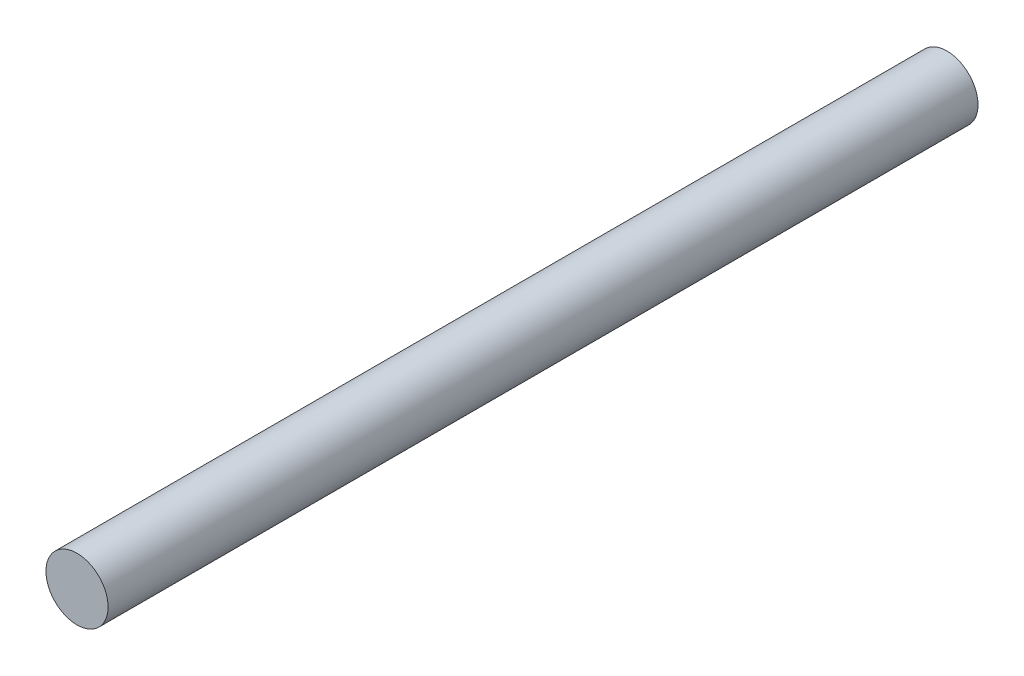
ISO-10303-21;
HEADER;
FILE_DESCRIPTION(('STEP AP214'),'2;1');
FILE_NAME('part.step','',(''),(''),'','','');
FILE_SCHEMA(('AUTOMOTIVE_DESIGN { 1 0 10303 214 1 1 1 1 }'));
ENDSEC;
DATA;
#1=APPLICATION_CONTEXT('core data for automotive mechanical design processes');
#2=APPLICATION_PROTOCOL_DEFINITION('international standard','automotive_design',2000,#1);
#3=PRODUCT_CONTEXT('',#1,'mechanical');
#4=PRODUCT('Part','Part','',(#3));
#5=PRODUCT_RELATED_PRODUCT_CATEGORY('part','',(#4));
#6=PRODUCT_DEFINITION_FORMATION('','',#4);
#7=PRODUCT_DEFINITION_CONTEXT('part definition',#1,'design');
#8=PRODUCT_DEFINITION('design','',#6,#7);
#9=PRODUCT_DEFINITION_SHAPE('','',#8);
#10=(LENGTH_UNIT() NAMED_UNIT(*) SI_UNIT(.MILLI.,.METRE.));
#11=(NAMED_UNIT(*) PLANE_ANGLE_UNIT() SI_UNIT($,.RADIAN.));
#12=(NAMED_UNIT(*) SI_UNIT($,.STERADIAN.) SOLID_ANGLE_UNIT());
#13=UNCERTAINTY_MEASURE_WITH_UNIT(LENGTH_MEASURE(1.E-05),#10,'distance_accuracy_value','');
#14=(GEOMETRIC_REPRESENTATION_CONTEXT(3) GLOBAL_UNCERTAINTY_ASSIGNED_CONTEXT((#13)) GLOBAL_UNIT_ASSIGNED_CONTEXT((#10,
#11,#12)) REPRESENTATION_CONTEXT('',''));
#15=CARTESIAN_POINT('',(0.,0.,0.));
#16=DIRECTION('',(0.,0.,1.));
#17=DIRECTION('',(1.,0.,0.));
#18=AXIS2_PLACEMENT_3D('',#15,#16,#17);
#19=CARTESIAN_POINT('',(0.,0.,140.));
#20=DIRECTION('',(0.,0.,-1.));
#21=DIRECTION('',(-1.,0.,0.));
#22=AXIS2_PLACEMENT_3D('',#19,#20,#21);
#23=CYLINDRICAL_SURFACE('',#22,5.);
#24=CARTESIAN_POINT('',(0.,0.,140.));
#25=DIRECTION('',(0.,0.,1.));
#26=DIRECTION('',(1.,0.,0.));
#27=AXIS2_PLACEMENT_3D('',#24,#25,#26);
#28=CIRCLE('',#27,5.);
#29=CARTESIAN_POINT('',(5.,0.,140.));
#30=VERTEX_POINT('',#29);
#31=EDGE_CURVE('E10',#30,#30,#28,.T.);
#32=ORIENTED_EDGE('',*,*,#31,.F.);
#33=EDGE_LOOP('',(#32));
#34=FACE_BOUND('',#33,.T.);
#35=CARTESIAN_POINT('',(0.,0.,0.));
#36=DIRECTION('',(0.,0.,1.));
#37=DIRECTION('',(1.,0.,0.));
#38=AXIS2_PLACEMENT_3D('',#35,#36,#37);
#39=CIRCLE('',#38,5.);
#40=CARTESIAN_POINT('',(5.,0.,0.));
#41=VERTEX_POINT('',#40);
#42=EDGE_CURVE('E34',#41,#41,#39,.T.);
#43=ORIENTED_EDGE('',*,*,#42,.T.);
#44=EDGE_LOOP('',(#43));
#45=FACE_BOUND('',#44,.T.);
#46=ADVANCED_FACE('F31',(#34,#45),#23,.T.);
#47=CARTESIAN_POINT('',(0.,0.,140.));
#48=DIRECTION('',(0.,0.,1.));
#49=DIRECTION('',(1.,0.,0.));
#50=AXIS2_PLACEMENT_3D('',#47,#48,#49);
#51=PLANE('',#50);
#52=ORIENTED_EDGE('',*,*,#31,.T.);
#53=EDGE_LOOP('',(#52));
#54=FACE_BOUND('',#53,.T.);
#55=ADVANCED_FACE('F46',(#54),#51,.T.);
#56=CARTESIAN_POINT('',(0.,0.,0.));
#57=DIRECTION('',(0.,0.,1.));
#58=DIRECTION('',(1.,0.,0.));
#59=AXIS2_PLACEMENT_3D('',#56,#57,#58);
#60=PLANE('',#59);
#61=ORIENTED_EDGE('',*,*,#42,.F.);
#62=EDGE_LOOP('',(#61));
#63=FACE_BOUND('',#62,.T.);
#64=ADVANCED_FACE('F44',(#63),#60,.F.);
#65=CLOSED_SHELL('',(#46,#55,#64));
#66=MANIFOLD_SOLID_BREP('B2',#65);
#67=ADVANCED_BREP_SHAPE_REPRESENTATION('',(#18,#66),#14);
#68=SHAPE_DEFINITION_REPRESENTATION(#9,#67);
ENDSEC;
END-ISO-10303-21;
